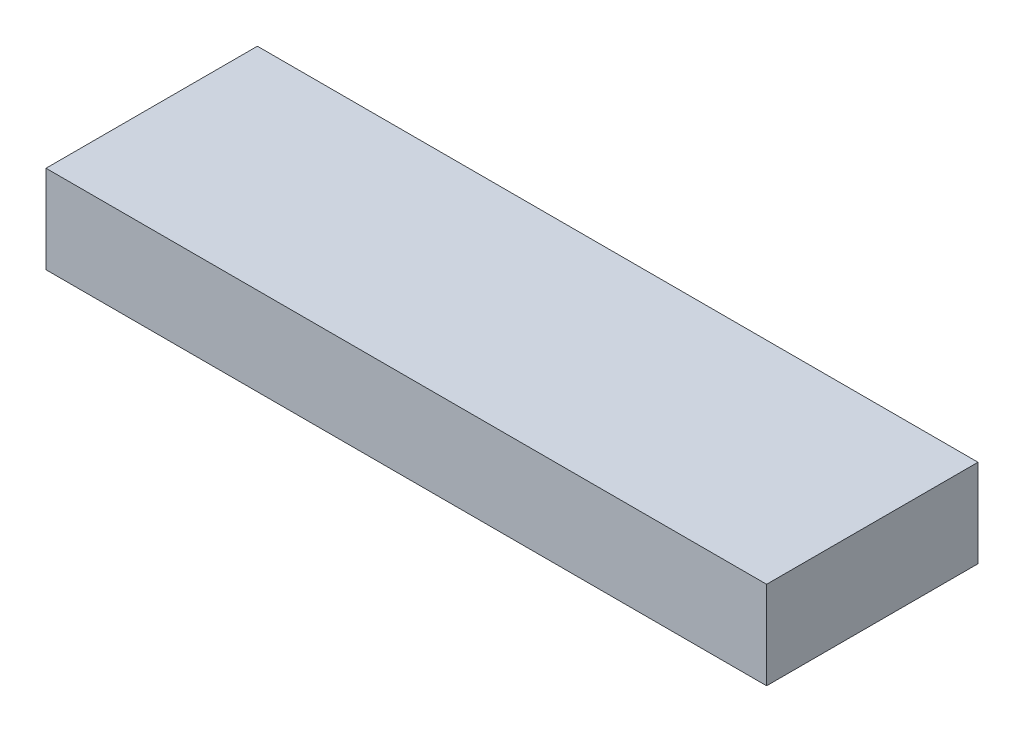
ISO-10303-21;
HEADER;
FILE_DESCRIPTION(('STEP AP214'),'2;1');
FILE_NAME('part.step','',(''),(''),'','','');
FILE_SCHEMA(('AUTOMOTIVE_DESIGN { 1 0 10303 214 1 1 1 1 }'));
ENDSEC;
DATA;
#1=APPLICATION_CONTEXT('core data for automotive mechanical design processes');
#2=APPLICATION_PROTOCOL_DEFINITION('international standard','automotive_design',2000,#1);
#3=PRODUCT_CONTEXT('',#1,'mechanical');
#4=PRODUCT('Part','Part','',(#3));
#5=PRODUCT_RELATED_PRODUCT_CATEGORY('part','',(#4));
#6=PRODUCT_DEFINITION_FORMATION('','',#4);
#7=PRODUCT_DEFINITION_CONTEXT('part definition',#1,'design');
#8=PRODUCT_DEFINITION('design','',#6,#7);
#9=PRODUCT_DEFINITION_SHAPE('','',#8);
#10=(LENGTH_UNIT() NAMED_UNIT(*) SI_UNIT(.MILLI.,.METRE.));
#11=(NAMED_UNIT(*) PLANE_ANGLE_UNIT() SI_UNIT($,.RADIAN.));
#12=(NAMED_UNIT(*) SI_UNIT($,.STERADIAN.) SOLID_ANGLE_UNIT());
#13=UNCERTAINTY_MEASURE_WITH_UNIT(LENGTH_MEASURE(1.E-05),#10,'distance_accuracy_value','');
#14=(GEOMETRIC_REPRESENTATION_CONTEXT(3) GLOBAL_UNCERTAINTY_ASSIGNED_CONTEXT((#13)) GLOBAL_UNIT_ASSIGNED_CONTEXT((#10,
#11,#12)) REPRESENTATION_CONTEXT('',''));
#15=CARTESIAN_POINT('',(0.,0.,0.));
#16=DIRECTION('',(0.,0.,1.));
#17=DIRECTION('',(1.,0.,0.));
#18=AXIS2_PLACEMENT_3D('',#15,#16,#17);
#19=CARTESIAN_POINT('',(9971.79090682812,3457.49212875944,600.));
#20=DIRECTION('',(-1.,0.,0.));
#21=DIRECTION('',(0.,0.,1.));
#22=AXIS2_PLACEMENT_3D('',#19,#20,#21);
#23=PLANE('',#22);
#24=DIRECTION('',(0.,1.,0.));
#25=VECTOR('',#24,1.);
#26=CARTESIAN_POINT('',(9971.79090682812,3457.49212875944,0.));
#27=LINE('',#26,#25);
#28=CARTESIAN_POINT('',(9971.79090682812,3207.93306848085,0.));
#29=VERTEX_POINT('',#28);
#30=CARTESIAN_POINT('',(9971.79090682812,3457.49212875944,0.));
#31=VERTEX_POINT('',#30);
#32=EDGE_CURVE('E95',#29,#31,#27,.T.);
#33=ORIENTED_EDGE('',*,*,#32,.T.);
#34=DIRECTION('',(0.,0.,-1.));
#35=VECTOR('',#34,1.);
#36=CARTESIAN_POINT('',(9971.79090682812,3457.49212875944,600.));
#37=LINE('',#36,#35);
#38=CARTESIAN_POINT('',(9971.79090682812,3457.49212875944,600.));
#39=VERTEX_POINT('',#38);
#40=EDGE_CURVE('E11',#39,#31,#37,.T.);
#41=ORIENTED_EDGE('',*,*,#40,.F.);
#42=DIRECTION('',(0.,1.,0.));
#43=VECTOR('',#42,1.);
#44=CARTESIAN_POINT('',(9971.79090682812,3457.49212875944,600.));
#45=LINE('',#44,#43);
#46=CARTESIAN_POINT('',(9971.79090682812,3207.93306848085,600.));
#47=VERTEX_POINT('',#46);
#48=EDGE_CURVE('E83',#47,#39,#45,.T.);
#49=ORIENTED_EDGE('',*,*,#48,.F.);
#50=DIRECTION('',(0.,0.,-1.));
#51=VECTOR('',#50,1.);
#52=CARTESIAN_POINT('',(9971.79090682812,3207.93306848085,600.));
#53=LINE('',#52,#51);
#54=EDGE_CURVE('E91',#47,#29,#53,.T.);
#55=ORIENTED_EDGE('',*,*,#54,.T.);
#56=EDGE_LOOP('',(#33,#41,#49,#55));
#57=FACE_BOUND('',#56,.T.);
#58=ADVANCED_FACE('F32',(#57),#23,.F.);
#59=CARTESIAN_POINT('',(9971.79090682812,3457.49212875944,600.));
#60=DIRECTION('',(0.,-1.,0.));
#61=DIRECTION('',(0.,0.,-1.));
#62=AXIS2_PLACEMENT_3D('',#59,#60,#61);
#63=PLANE('',#62);
#64=DIRECTION('',(-1.,0.,0.));
#65=VECTOR('',#64,1.);
#66=CARTESIAN_POINT('',(9971.79090682812,3457.49212875944,0.));
#67=LINE('',#66,#65);
#68=CARTESIAN_POINT('',(7926.49165193628,3457.49212875944,0.));
#69=VERTEX_POINT('',#68);
#70=EDGE_CURVE('E87',#31,#69,#67,.T.);
#71=ORIENTED_EDGE('',*,*,#70,.T.);
#72=DIRECTION('',(0.,0.,-1.));
#73=VECTOR('',#72,1.);
#74=CARTESIAN_POINT('',(7926.49165193628,3457.49212875944,600.));
#75=LINE('',#74,#73);
#76=CARTESIAN_POINT('',(7926.49165193628,3457.49212875944,600.));
#77=VERTEX_POINT('',#76);
#78=EDGE_CURVE('E40',#77,#69,#75,.T.);
#79=ORIENTED_EDGE('',*,*,#78,.F.);
#80=DIRECTION('',(-1.,0.,0.));
#81=VECTOR('',#80,1.);
#82=CARTESIAN_POINT('',(9971.79090682812,3457.49212875944,600.));
#83=LINE('',#82,#81);
#84=EDGE_CURVE('E78',#39,#77,#83,.T.);
#85=ORIENTED_EDGE('',*,*,#84,.F.);
#86=ORIENTED_EDGE('',*,*,#40,.T.);
#87=EDGE_LOOP('',(#71,#79,#85,#86));
#88=FACE_BOUND('',#87,.T.);
#89=ADVANCED_FACE('F86',(#88),#63,.F.);
#90=CARTESIAN_POINT('',(7926.49165193628,3457.49212875944,600.));
#91=DIRECTION('',(1.,0.,0.));
#92=DIRECTION('',(0.,0.,-1.));
#93=AXIS2_PLACEMENT_3D('',#90,#91,#92);
#94=PLANE('',#93);
#95=DIRECTION('',(0.,-1.,0.));
#96=VECTOR('',#95,1.);
#97=CARTESIAN_POINT('',(7926.49165193628,3457.49212875944,0.));
#98=LINE('',#97,#96);
#99=CARTESIAN_POINT('',(7926.49165193628,3207.93306848085,0.));
#100=VERTEX_POINT('',#99);
#101=EDGE_CURVE('E65',#69,#100,#98,.T.);
#102=ORIENTED_EDGE('',*,*,#101,.T.);
#103=DIRECTION('',(0.,0.,-1.));
#104=VECTOR('',#103,1.);
#105=CARTESIAN_POINT('',(7926.49165193628,3207.93306848085,600.));
#106=LINE('',#105,#104);
#107=CARTESIAN_POINT('',(7926.49165193628,3207.93306848085,600.));
#108=VERTEX_POINT('',#107);
#109=EDGE_CURVE('E88',#108,#100,#106,.T.);
#110=ORIENTED_EDGE('',*,*,#109,.F.);
#111=DIRECTION('',(0.,-1.,0.));
#112=VECTOR('',#111,1.);
#113=CARTESIAN_POINT('',(7926.49165193628,3457.49212875944,600.));
#114=LINE('',#113,#112);
#115=EDGE_CURVE('E81',#77,#108,#114,.T.);
#116=ORIENTED_EDGE('',*,*,#115,.F.);
#117=ORIENTED_EDGE('',*,*,#78,.T.);
#118=EDGE_LOOP('',(#102,#110,#116,#117));
#119=FACE_BOUND('',#118,.T.);
#120=ADVANCED_FACE('F89',(#119),#94,.F.);
#121=CARTESIAN_POINT('',(9971.79090682812,3207.93306848085,600.));
#122=DIRECTION('',(0.,1.,0.));
#123=DIRECTION('',(0.,0.,1.));
#124=AXIS2_PLACEMENT_3D('',#121,#122,#123);
#125=PLANE('',#124);
#126=DIRECTION('',(1.,0.,0.));
#127=VECTOR('',#126,1.);
#128=CARTESIAN_POINT('',(9971.79090682812,3207.93306848085,0.));
#129=LINE('',#128,#127);
#130=EDGE_CURVE('E71',#100,#29,#129,.T.);
#131=ORIENTED_EDGE('',*,*,#130,.T.);
#132=ORIENTED_EDGE('',*,*,#54,.F.);
#133=DIRECTION('',(1.,0.,0.));
#134=VECTOR('',#133,1.);
#135=CARTESIAN_POINT('',(9971.79090682812,3207.93306848085,600.));
#136=LINE('',#135,#134);
#137=EDGE_CURVE('E48',#108,#47,#136,.T.);
#138=ORIENTED_EDGE('',*,*,#137,.F.);
#139=ORIENTED_EDGE('',*,*,#109,.T.);
#140=EDGE_LOOP('',(#131,#132,#138,#139));
#141=FACE_BOUND('',#140,.T.);
#142=ADVANCED_FACE('F102',(#141),#125,.F.);
#143=CARTESIAN_POINT('',(0.,0.,600.));
#144=DIRECTION('',(0.,0.,-1.));
#145=DIRECTION('',(-1.,0.,0.));
#146=AXIS2_PLACEMENT_3D('',#143,#144,#145);
#147=PLANE('',#146);
#148=ORIENTED_EDGE('',*,*,#48,.T.);
#149=ORIENTED_EDGE('',*,*,#84,.T.);
#150=ORIENTED_EDGE('',*,*,#115,.T.);
#151=ORIENTED_EDGE('',*,*,#137,.T.);
#152=EDGE_LOOP('',(#148,#149,#150,#151));
#153=FACE_BOUND('',#152,.T.);
#154=ADVANCED_FACE('F79',(#153),#147,.F.);
#155=CARTESIAN_POINT('',(0.,0.,0.));
#156=DIRECTION('',(0.,0.,-1.));
#157=DIRECTION('',(-1.,0.,0.));
#158=AXIS2_PLACEMENT_3D('',#155,#156,#157);
#159=PLANE('',#158);
#160=ORIENTED_EDGE('',*,*,#32,.F.);
#161=ORIENTED_EDGE('',*,*,#130,.F.);
#162=ORIENTED_EDGE('',*,*,#101,.F.);
#163=ORIENTED_EDGE('',*,*,#70,.F.);
#164=EDGE_LOOP('',(#160,#161,#162,#163));
#165=FACE_BOUND('',#164,.T.);
#166=ADVANCED_FACE('F105',(#165),#159,.T.);
#167=CLOSED_SHELL('',(#58,#89,#120,#142,#154,#166));
#168=MANIFOLD_SOLID_BREP('B2',#167);
#169=ADVANCED_BREP_SHAPE_REPRESENTATION('',(#18,#168),#14);
#170=SHAPE_DEFINITION_REPRESENTATION(#9,#169);
ENDSEC;
END-ISO-10303-21;
